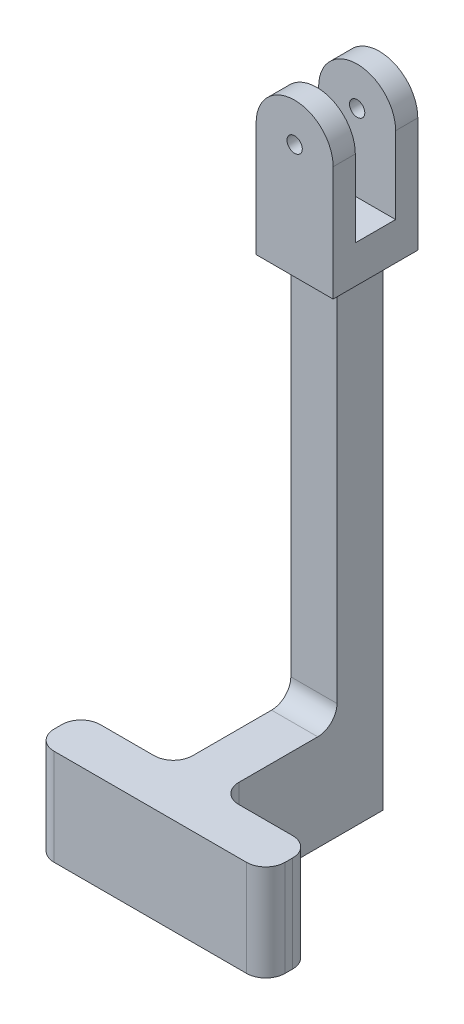
ISO-10303-21;
HEADER;
FILE_DESCRIPTION(('STEP AP214'),'2;1');
FILE_NAME('part.step','',(''),(''),'','','');
FILE_SCHEMA(('AUTOMOTIVE_DESIGN { 1 0 10303 214 1 1 1 1 }'));
ENDSEC;
DATA;
#1=APPLICATION_CONTEXT('core data for automotive mechanical design processes');
#2=APPLICATION_PROTOCOL_DEFINITION('international standard','automotive_design',2000,#1);
#3=PRODUCT_CONTEXT('',#1,'mechanical');
#4=PRODUCT('Part','Part','',(#3));
#5=PRODUCT_RELATED_PRODUCT_CATEGORY('part','',(#4));
#6=PRODUCT_DEFINITION_FORMATION('','',#4);
#7=PRODUCT_DEFINITION_CONTEXT('part definition',#1,'design');
#8=PRODUCT_DEFINITION('design','',#6,#7);
#9=PRODUCT_DEFINITION_SHAPE('','',#8);
#10=(LENGTH_UNIT() NAMED_UNIT(*) SI_UNIT(.MILLI.,.METRE.));
#11=(NAMED_UNIT(*) PLANE_ANGLE_UNIT() SI_UNIT($,.RADIAN.));
#12=(NAMED_UNIT(*) SI_UNIT($,.STERADIAN.) SOLID_ANGLE_UNIT());
#13=UNCERTAINTY_MEASURE_WITH_UNIT(LENGTH_MEASURE(1.E-05),#10,'distance_accuracy_value','');
#14=(GEOMETRIC_REPRESENTATION_CONTEXT(3) GLOBAL_UNCERTAINTY_ASSIGNED_CONTEXT((#13)) GLOBAL_UNIT_ASSIGNED_CONTEXT((#10,
#11,#12)) REPRESENTATION_CONTEXT('',''));
#15=CARTESIAN_POINT('',(0.,0.,0.));
#16=DIRECTION('',(0.,0.,1.));
#17=DIRECTION('',(1.,0.,0.));
#18=AXIS2_PLACEMENT_3D('',#15,#16,#17);
#19=CARTESIAN_POINT('',(0.,-130.276417548068,0.));
#20=DIRECTION('',(0.,0.,1.));
#21=DIRECTION('',(1.,0.,0.));
#22=AXIS2_PLACEMENT_3D('',#19,#20,#21);
#23=PLANE('',#22);
#24=DIRECTION('',(0.,1.,0.));
#25=VECTOR('',#24,1.);
#26=CARTESIAN_POINT('',(6.,-130.276417548068,0.));
#27=LINE('',#26,#25);
#28=CARTESIAN_POINT('',(6.,-155.276417548068,0.));
#29=VERTEX_POINT('',#28);
#30=CARTESIAN_POINT('',(6.,-30.2764175480678,0.));
#31=VERTEX_POINT('',#30);
#32=EDGE_CURVE('E262',#29,#31,#27,.T.);
#33=ORIENTED_EDGE('',*,*,#32,.F.);
#34=DIRECTION('',(1.,0.,0.));
#35=VECTOR('',#34,1.);
#36=CARTESIAN_POINT('',(-6.,-155.276417548068,0.));
#37=LINE('',#36,#35);
#38=CARTESIAN_POINT('',(-6.,-155.276417548068,0.));
#39=VERTEX_POINT('',#38);
#40=EDGE_CURVE('E249',#39,#29,#37,.T.);
#41=ORIENTED_EDGE('',*,*,#40,.F.);
#42=DIRECTION('',(0.,1.,0.));
#43=VECTOR('',#42,1.);
#44=CARTESIAN_POINT('',(-6.,-130.276417548068,0.));
#45=LINE('',#44,#43);
#46=CARTESIAN_POINT('',(-6.,-30.2764175480678,0.));
#47=VERTEX_POINT('',#46);
#48=EDGE_CURVE('E254',#39,#47,#45,.T.);
#49=ORIENTED_EDGE('',*,*,#48,.T.);
#50=DIRECTION('',(1.,0.,0.));
#51=VECTOR('',#50,1.);
#52=CARTESIAN_POINT('',(0.,-30.2764175480678,0.));
#53=LINE('',#52,#51);
#54=EDGE_CURVE('E295',#47,#31,#53,.T.);
#55=ORIENTED_EDGE('',*,*,#54,.T.);
#56=EDGE_LOOP('',(#33,#41,#49,#55));
#57=FACE_BOUND('',#56,.T.);
#58=ADVANCED_FACE('F67',(#57),#23,.F.);
#59=CARTESIAN_POINT('',(10.,0.,12.));
#60=DIRECTION('',(-1.,0.,0.));
#61=DIRECTION('',(0.,-1.,0.));
#62=AXIS2_PLACEMENT_3D('',#59,#60,#61);
#63=PLANE('',#62);
#64=DIRECTION('',(0.,1.,0.));
#65=VECTOR('',#64,1.);
#66=CARTESIAN_POINT('',(10.,0.,17.));
#67=LINE('',#66,#65);
#68=CARTESIAN_POINT('',(10.,-29.7764175480678,17.));
#69=VERTEX_POINT('',#68);
#70=CARTESIAN_POINT('',(10.,0.,17.));
#71=VERTEX_POINT('',#70);
#72=EDGE_CURVE('E327',#69,#71,#67,.T.);
#73=ORIENTED_EDGE('',*,*,#72,.F.);
#74=DIRECTION('',(0.,0.,-1.));
#75=VECTOR('',#74,1.);
#76=CARTESIAN_POINT('',(10.,-29.7764175480678,12.));
#77=LINE('',#76,#75);
#78=CARTESIAN_POINT('',(10.,-29.7764175480678,-5.));
#79=VERTEX_POINT('',#78);
#80=EDGE_CURVE('E392',#69,#79,#77,.T.);
#81=ORIENTED_EDGE('',*,*,#80,.T.);
#82=DIRECTION('',(0.,-1.,0.));
#83=VECTOR('',#82,1.);
#84=CARTESIAN_POINT('',(10.,0.,-5.));
#85=LINE('',#84,#83);
#86=CARTESIAN_POINT('',(10.,0.,-5.));
#87=VERTEX_POINT('',#86);
#88=EDGE_CURVE('E313',#87,#79,#85,.T.);
#89=ORIENTED_EDGE('',*,*,#88,.F.);
#90=DIRECTION('',(0.,0.,-1.));
#91=VECTOR('',#90,1.);
#92=CARTESIAN_POINT('',(10.,0.,12.));
#93=LINE('',#92,#91);
#94=CARTESIAN_POINT('',(10.,0.,0.759999999999997));
#95=VERTEX_POINT('',#94);
#96=EDGE_CURVE('E337',#95,#87,#93,.T.);
#97=ORIENTED_EDGE('',*,*,#96,.F.);
#98=DIRECTION('',(0.,-1.,0.));
#99=VECTOR('',#98,1.);
#100=CARTESIAN_POINT('',(10.,0.,0.759999999999997));
#101=LINE('',#100,#99);
#102=CARTESIAN_POINT('',(10.,-20.,0.759999999999997));
#103=VERTEX_POINT('',#102);
#104=EDGE_CURVE('E291',#95,#103,#101,.T.);
#105=ORIENTED_EDGE('',*,*,#104,.T.);
#106=DIRECTION('',(0.,0.,-1.));
#107=VECTOR('',#106,1.);
#108=CARTESIAN_POINT('',(10.,-20.,0.));
#109=LINE('',#108,#107);
#110=CARTESIAN_POINT('',(10.,-20.,11.24));
#111=VERTEX_POINT('',#110);
#112=EDGE_CURVE('E329',#111,#103,#109,.T.);
#113=ORIENTED_EDGE('',*,*,#112,.F.);
#114=DIRECTION('',(0.,1.,0.));
#115=VECTOR('',#114,1.);
#116=CARTESIAN_POINT('',(10.,0.,11.24));
#117=LINE('',#116,#115);
#118=CARTESIAN_POINT('',(10.,0.,11.24));
#119=VERTEX_POINT('',#118);
#120=EDGE_CURVE('E284',#111,#119,#117,.T.);
#121=ORIENTED_EDGE('',*,*,#120,.T.);
#122=EDGE_CURVE('E338',#71,#119,#93,.T.);
#123=ORIENTED_EDGE('',*,*,#122,.F.);
#124=EDGE_LOOP('',(#73,#81,#89,#97,#105,#113,#121,#123));
#125=FACE_BOUND('',#124,.T.);
#126=ADVANCED_FACE('F509',(#125),#63,.F.);
#127=CARTESIAN_POINT('',(0.,0.,12.));
#128=DIRECTION('',(0.,0.,-1.));
#129=DIRECTION('',(-1.,0.,0.));
#130=AXIS2_PLACEMENT_3D('',#127,#128,#129);
#131=CYLINDRICAL_SURFACE('',#130,10.);
#132=DIRECTION('',(0.,0.,-1.));
#133=VECTOR('',#132,1.);
#134=CARTESIAN_POINT('',(-10.,0.,12.));
#135=LINE('',#134,#133);
#136=CARTESIAN_POINT('',(-10.,0.,0.759999999999997));
#137=VERTEX_POINT('',#136);
#138=CARTESIAN_POINT('',(-10.,0.,-5.));
#139=VERTEX_POINT('',#138);
#140=EDGE_CURVE('E332',#137,#139,#135,.T.);
#141=ORIENTED_EDGE('',*,*,#140,.F.);
#142=CARTESIAN_POINT('',(0.,0.,0.759999999999997));
#143=DIRECTION('',(0.,0.,-1.));
#144=DIRECTION('',(-1.,0.,0.));
#145=AXIS2_PLACEMENT_3D('',#142,#143,#144);
#146=CIRCLE('',#145,10.);
#147=EDGE_CURVE('E288',#137,#95,#146,.T.);
#148=ORIENTED_EDGE('',*,*,#147,.T.);
#149=ORIENTED_EDGE('',*,*,#96,.T.);
#150=CARTESIAN_POINT('',(0.,0.,-5.));
#151=DIRECTION('',(0.,0.,-1.));
#152=DIRECTION('',(-1.,0.,0.));
#153=AXIS2_PLACEMENT_3D('',#150,#151,#152);
#154=CIRCLE('',#153,10.);
#155=EDGE_CURVE('E310',#139,#87,#154,.T.);
#156=ORIENTED_EDGE('',*,*,#155,.F.);
#157=EDGE_LOOP('',(#141,#148,#149,#156));
#158=FACE_BOUND('',#157,.T.);
#159=ADVANCED_FACE('F514',(#158),#131,.T.);
#160=CARTESIAN_POINT('',(-10.,0.,12.));
#161=DIRECTION('',(1.,0.,0.));
#162=DIRECTION('',(0.,1.,0.));
#163=AXIS2_PLACEMENT_3D('',#160,#161,#162);
#164=PLANE('',#163);
#165=DIRECTION('',(0.,1.,0.));
#166=VECTOR('',#165,1.);
#167=CARTESIAN_POINT('',(-10.,0.,-5.));
#168=LINE('',#167,#166);
#169=CARTESIAN_POINT('',(-10.,-29.7764175480678,-5.));
#170=VERTEX_POINT('',#169);
#171=EDGE_CURVE('E316',#170,#139,#168,.T.);
#172=ORIENTED_EDGE('',*,*,#171,.F.);
#173=DIRECTION('',(0.,0.,1.));
#174=VECTOR('',#173,1.);
#175=CARTESIAN_POINT('',(-10.,-29.7764175480678,12.));
#176=LINE('',#175,#174);
#177=CARTESIAN_POINT('',(-10.,-29.7764175480678,17.));
#178=VERTEX_POINT('',#177);
#179=EDGE_CURVE('E406',#170,#178,#176,.T.);
#180=ORIENTED_EDGE('',*,*,#179,.T.);
#181=DIRECTION('',(0.,-1.,0.));
#182=VECTOR('',#181,1.);
#183=CARTESIAN_POINT('',(-10.,0.,17.));
#184=LINE('',#183,#182);
#185=CARTESIAN_POINT('',(-10.,0.,17.));
#186=VERTEX_POINT('',#185);
#187=EDGE_CURVE('E324',#186,#178,#184,.T.);
#188=ORIENTED_EDGE('',*,*,#187,.F.);
#189=CARTESIAN_POINT('',(-10.,0.,11.24));
#190=VERTEX_POINT('',#189);
#191=EDGE_CURVE('E334',#186,#190,#135,.T.);
#192=ORIENTED_EDGE('',*,*,#191,.T.);
#193=DIRECTION('',(0.,1.,0.));
#194=VECTOR('',#193,1.);
#195=CARTESIAN_POINT('',(-10.,0.,11.24));
#196=LINE('',#195,#194);
#197=CARTESIAN_POINT('',(-10.,-20.,11.24));
#198=VERTEX_POINT('',#197);
#199=EDGE_CURVE('E272',#198,#190,#196,.T.);
#200=ORIENTED_EDGE('',*,*,#199,.F.);
#201=DIRECTION('',(0.,0.,-1.));
#202=VECTOR('',#201,1.);
#203=CARTESIAN_POINT('',(-10.,-20.,0.));
#204=LINE('',#203,#202);
#205=CARTESIAN_POINT('',(-10.,-20.,0.759999999999997));
#206=VERTEX_POINT('',#205);
#207=EDGE_CURVE('E330',#198,#206,#204,.T.);
#208=ORIENTED_EDGE('',*,*,#207,.T.);
#209=DIRECTION('',(0.,-1.,0.));
#210=VECTOR('',#209,1.);
#211=CARTESIAN_POINT('',(-10.,0.,0.759999999999997));
#212=LINE('',#211,#210);
#213=EDGE_CURVE('E266',#137,#206,#212,.T.);
#214=ORIENTED_EDGE('',*,*,#213,.F.);
#215=ORIENTED_EDGE('',*,*,#140,.T.);
#216=EDGE_LOOP('',(#172,#180,#188,#192,#200,#208,#214,#215));
#217=FACE_BOUND('',#216,.T.);
#218=ADVANCED_FACE('F539',(#217),#164,.F.);
#219=CARTESIAN_POINT('',(0.,0.,12.));
#220=DIRECTION('',(0.,0.,-1.));
#221=DIRECTION('',(-1.,0.,0.));
#222=AXIS2_PLACEMENT_3D('',#219,#220,#221);
#223=CYLINDRICAL_SURFACE('',#222,1.985);
#224=CARTESIAN_POINT('',(0.,0.,0.759999999999997));
#225=DIRECTION('',(0.,0.,-1.));
#226=DIRECTION('',(-1.,0.,0.));
#227=AXIS2_PLACEMENT_3D('',#224,#225,#226);
#228=CIRCLE('',#227,1.985);
#229=CARTESIAN_POINT('',(-1.985,0.,0.759999999999997));
#230=VERTEX_POINT('',#229);
#231=EDGE_CURVE('E287',#230,#230,#228,.T.);
#232=ORIENTED_EDGE('',*,*,#231,.F.);
#233=EDGE_LOOP('',(#232));
#234=FACE_BOUND('',#233,.T.);
#235=CARTESIAN_POINT('',(0.,0.,-5.));
#236=DIRECTION('',(0.,0.,-1.));
#237=DIRECTION('',(-1.,0.,0.));
#238=AXIS2_PLACEMENT_3D('',#235,#236,#237);
#239=CIRCLE('',#238,1.985);
#240=CARTESIAN_POINT('',(-1.985,0.,-5.));
#241=VERTEX_POINT('',#240);
#242=EDGE_CURVE('E261',#241,#241,#239,.F.);
#243=ORIENTED_EDGE('',*,*,#242,.F.);
#244=EDGE_LOOP('',(#243));
#245=FACE_BOUND('',#244,.T.);
#246=ADVANCED_FACE('F542',(#234,#245),#223,.F.);
#247=CARTESIAN_POINT('',(0.,0.,11.24));
#248=DIRECTION('',(0.,0.,1.));
#249=DIRECTION('',(1.,0.,0.));
#250=AXIS2_PLACEMENT_3D('',#247,#248,#249);
#251=CIRCLE('',#250,10.);
#252=EDGE_CURVE('E282',#119,#190,#251,.T.);
#253=ORIENTED_EDGE('',*,*,#252,.T.);
#254=ORIENTED_EDGE('',*,*,#191,.F.);
#255=CARTESIAN_POINT('',(0.,0.,17.));
#256=DIRECTION('',(0.,0.,1.));
#257=DIRECTION('',(1.,0.,0.));
#258=AXIS2_PLACEMENT_3D('',#255,#256,#257);
#259=CIRCLE('',#258,10.);
#260=EDGE_CURVE('E321',#71,#186,#259,.T.);
#261=ORIENTED_EDGE('',*,*,#260,.F.);
#262=ORIENTED_EDGE('',*,*,#122,.T.);
#263=EDGE_LOOP('',(#253,#254,#261,#262));
#264=FACE_BOUND('',#263,.T.);
#265=ADVANCED_FACE('F546',(#264),#131,.T.);
#266=CARTESIAN_POINT('',(0.,0.,11.24));
#267=DIRECTION('',(0.,0.,1.));
#268=DIRECTION('',(1.,0.,0.));
#269=AXIS2_PLACEMENT_3D('',#266,#267,#268);
#270=CIRCLE('',#269,1.985);
#271=CARTESIAN_POINT('',(1.985,0.,11.24));
#272=VERTEX_POINT('',#271);
#273=EDGE_CURVE('E279',#272,#272,#270,.T.);
#274=ORIENTED_EDGE('',*,*,#273,.F.);
#275=EDGE_LOOP('',(#274));
#276=FACE_BOUND('',#275,.T.);
#277=CARTESIAN_POINT('',(0.,0.,17.));
#278=DIRECTION('',(0.,0.,1.));
#279=DIRECTION('',(1.,0.,0.));
#280=AXIS2_PLACEMENT_3D('',#277,#278,#279);
#281=CIRCLE('',#280,1.985);
#282=CARTESIAN_POINT('',(1.985,0.,17.));
#283=VERTEX_POINT('',#282);
#284=EDGE_CURVE('E318',#283,#283,#281,.F.);
#285=ORIENTED_EDGE('',*,*,#284,.F.);
#286=EDGE_LOOP('',(#285));
#287=FACE_BOUND('',#286,.T.);
#288=ADVANCED_FACE('F537',(#276,#287),#223,.F.);
#289=CARTESIAN_POINT('',(0.,-30.2764175480678,12.));
#290=DIRECTION('',(0.,1.,0.));
#291=DIRECTION('',(0.,0.,1.));
#292=AXIS2_PLACEMENT_3D('',#289,#290,#291);
#293=PLANE('',#292);
#294=DIRECTION('',(1.,0.,0.));
#295=VECTOR('',#294,1.);
#296=CARTESIAN_POINT('',(10.,-30.2764175480678,-4.5));
#297=LINE('',#296,#295);
#298=CARTESIAN_POINT('',(-9.5,-30.2764175480678,-4.5));
#299=VERTEX_POINT('',#298);
#300=CARTESIAN_POINT('',(9.5,-30.2764175480678,-4.5));
#301=VERTEX_POINT('',#300);
#302=EDGE_CURVE('E395',#299,#301,#297,.T.);
#303=ORIENTED_EDGE('',*,*,#302,.T.);
#304=DIRECTION('',(0.,0.,1.));
#305=VECTOR('',#304,1.);
#306=CARTESIAN_POINT('',(9.5,-30.2764175480678,12.));
#307=LINE('',#306,#305);
#308=CARTESIAN_POINT('',(9.5,-30.2764175480678,16.5));
#309=VERTEX_POINT('',#308);
#310=EDGE_CURVE('E401',#301,#309,#307,.T.);
#311=ORIENTED_EDGE('',*,*,#310,.T.);
#312=DIRECTION('',(-1.,0.,0.));
#313=VECTOR('',#312,1.);
#314=CARTESIAN_POINT('',(-10.,-30.2764175480678,16.5));
#315=LINE('',#314,#313);
#316=CARTESIAN_POINT('',(-9.5,-30.2764175480678,16.5));
#317=VERTEX_POINT('',#316);
#318=EDGE_CURVE('E399',#309,#317,#315,.T.);
#319=ORIENTED_EDGE('',*,*,#318,.T.);
#320=DIRECTION('',(0.,0.,-1.));
#321=VECTOR('',#320,1.);
#322=CARTESIAN_POINT('',(-9.5,-30.2764175480678,12.));
#323=LINE('',#322,#321);
#324=EDGE_CURVE('E397',#317,#299,#323,.T.);
#325=ORIENTED_EDGE('',*,*,#324,.T.);
#326=EDGE_LOOP('',(#303,#311,#319,#325));
#327=FACE_BOUND('',#326,.T.);
#328=ORIENTED_EDGE('',*,*,#54,.F.);
#329=DIRECTION('',(0.,0.,1.));
#330=VECTOR('',#329,1.);
#331=CARTESIAN_POINT('',(-6.,-30.2764175480678,0.));
#332=LINE('',#331,#330);
#333=CARTESIAN_POINT('',(-6.,-30.2764175480678,12.));
#334=VERTEX_POINT('',#333);
#335=EDGE_CURVE('E257',#47,#334,#332,.T.);
#336=ORIENTED_EDGE('',*,*,#335,.T.);
#337=DIRECTION('',(1.,0.,0.));
#338=VECTOR('',#337,1.);
#339=CARTESIAN_POINT('',(0.,-30.2764175480678,12.));
#340=LINE('',#339,#338);
#341=CARTESIAN_POINT('',(6.,-30.2764175480678,12.));
#342=VERTEX_POINT('',#341);
#343=EDGE_CURVE('E300',#334,#342,#340,.T.);
#344=ORIENTED_EDGE('',*,*,#343,.T.);
#345=DIRECTION('',(0.,0.,1.));
#346=VECTOR('',#345,1.);
#347=CARTESIAN_POINT('',(6.,-30.2764175480678,0.));
#348=LINE('',#347,#346);
#349=EDGE_CURVE('E297',#31,#342,#348,.T.);
#350=ORIENTED_EDGE('',*,*,#349,.F.);
#351=EDGE_LOOP('',(#328,#336,#344,#350));
#352=FACE_BOUND('',#351,.T.);
#353=ADVANCED_FACE('F533',(#327,#352),#293,.F.);
#354=CARTESIAN_POINT('',(-10.,-20.,0.));
#355=DIRECTION('',(0.,-1.,0.));
#356=DIRECTION('',(0.,0.,-1.));
#357=AXIS2_PLACEMENT_3D('',#354,#355,#356);
#358=PLANE('',#357);
#359=ORIENTED_EDGE('',*,*,#112,.T.);
#360=DIRECTION('',(-1.,0.,0.));
#361=VECTOR('',#360,1.);
#362=CARTESIAN_POINT('',(176.,-20.,0.759999999999997));
#363=LINE('',#362,#361);
#364=EDGE_CURVE('E275',#103,#206,#363,.T.);
#365=ORIENTED_EDGE('',*,*,#364,.T.);
#366=ORIENTED_EDGE('',*,*,#207,.F.);
#367=DIRECTION('',(-1.,0.,0.));
#368=VECTOR('',#367,1.);
#369=CARTESIAN_POINT('',(176.,-20.,11.24));
#370=LINE('',#369,#368);
#371=EDGE_CURVE('E276',#111,#198,#370,.T.);
#372=ORIENTED_EDGE('',*,*,#371,.F.);
#373=EDGE_LOOP('',(#359,#365,#366,#372));
#374=FACE_BOUND('',#373,.T.);
#375=ADVANCED_FACE('F529',(#374),#358,.F.);
#376=CARTESIAN_POINT('',(0.,0.,17.));
#377=DIRECTION('',(0.,0.,1.));
#378=DIRECTION('',(1.,0.,0.));
#379=AXIS2_PLACEMENT_3D('',#376,#377,#378);
#380=PLANE('',#379);
#381=ORIENTED_EDGE('',*,*,#284,.T.);
#382=EDGE_LOOP('',(#381));
#383=FACE_BOUND('',#382,.T.);
#384=ORIENTED_EDGE('',*,*,#187,.T.);
#385=DIRECTION('',(1.,0.,0.));
#386=VECTOR('',#385,1.);
#387=CARTESIAN_POINT('',(10.,-29.7764175480678,17.));
#388=LINE('',#387,#386);
#389=EDGE_CURVE('E404',#178,#69,#388,.T.);
#390=ORIENTED_EDGE('',*,*,#389,.T.);
#391=ORIENTED_EDGE('',*,*,#72,.T.);
#392=ORIENTED_EDGE('',*,*,#260,.T.);
#393=EDGE_LOOP('',(#384,#390,#391,#392));
#394=FACE_BOUND('',#393,.T.);
#395=ADVANCED_FACE('F525',(#383,#394),#380,.T.);
#396=CARTESIAN_POINT('',(0.,0.,-5.));
#397=DIRECTION('',(0.,0.,-1.));
#398=DIRECTION('',(-1.,0.,0.));
#399=AXIS2_PLACEMENT_3D('',#396,#397,#398);
#400=PLANE('',#399);
#401=ORIENTED_EDGE('',*,*,#242,.T.);
#402=EDGE_LOOP('',(#401));
#403=FACE_BOUND('',#402,.T.);
#404=ORIENTED_EDGE('',*,*,#88,.T.);
#405=DIRECTION('',(-1.,0.,0.));
#406=VECTOR('',#405,1.);
#407=CARTESIAN_POINT('',(-10.,-29.7764175480678,-5.));
#408=LINE('',#407,#406);
#409=EDGE_CURVE('E408',#79,#170,#408,.T.);
#410=ORIENTED_EDGE('',*,*,#409,.T.);
#411=ORIENTED_EDGE('',*,*,#171,.T.);
#412=ORIENTED_EDGE('',*,*,#155,.T.);
#413=EDGE_LOOP('',(#404,#410,#411,#412));
#414=FACE_BOUND('',#413,.T.);
#415=ADVANCED_FACE('F522',(#403,#414),#400,.T.);
#416=CARTESIAN_POINT('',(-6.,-130.276417548068,0.));
#417=DIRECTION('',(-1.,0.,0.));
#418=DIRECTION('',(0.,0.,1.));
#419=AXIS2_PLACEMENT_3D('',#416,#417,#418);
#420=PLANE('',#419);
#421=DIRECTION('',(0.,0.,-1.));
#422=VECTOR('',#421,1.);
#423=CARTESIAN_POINT('',(-6.,-155.276417548068,29.9201970855008));
#424=LINE('',#423,#422);
#425=CARTESIAN_POINT('',(-6.,-155.276417548068,37.5));
#426=VERTEX_POINT('',#425);
#427=EDGE_CURVE('E243',#426,#39,#424,.T.);
#428=ORIENTED_EDGE('',*,*,#427,.F.);
#429=DIRECTION('',(0.,-1.,0.));
#430=VECTOR('',#429,1.);
#431=CARTESIAN_POINT('',(-6.,-130.276417548068,37.5));
#432=LINE('',#431,#430);
#433=CARTESIAN_POINT('',(-6.,-130.276417548068,37.5));
#434=VERTEX_POINT('',#433);
#435=EDGE_CURVE('E88',#426,#434,#432,.F.);
#436=ORIENTED_EDGE('',*,*,#435,.T.);
#437=DIRECTION('',(0.,0.,1.));
#438=VECTOR('',#437,1.);
#439=CARTESIAN_POINT('',(-6.,-130.276417548068,0.));
#440=LINE('',#439,#438);
#441=CARTESIAN_POINT('',(-6.,-130.276417548068,17.));
#442=VERTEX_POINT('',#441);
#443=EDGE_CURVE('E457',#442,#434,#440,.T.);
#444=ORIENTED_EDGE('',*,*,#443,.F.);
#445=CARTESIAN_POINT('',(-6.,-125.276417548068,17.));
#446=DIRECTION('',(-1.,0.,0.));
#447=DIRECTION('',(0.,0.,1.));
#448=AXIS2_PLACEMENT_3D('',#445,#446,#447);
#449=CIRCLE('',#448,5.);
#450=CARTESIAN_POINT('',(-6.,-125.276417548068,12.));
#451=VERTEX_POINT('',#450);
#452=EDGE_CURVE('E388',#442,#451,#449,.F.);
#453=ORIENTED_EDGE('',*,*,#452,.T.);
#454=DIRECTION('',(0.,1.,0.));
#455=VECTOR('',#454,1.);
#456=CARTESIAN_POINT('',(-6.,-130.276417548068,12.));
#457=LINE('',#456,#455);
#458=EDGE_CURVE('E303',#451,#334,#457,.T.);
#459=ORIENTED_EDGE('',*,*,#458,.T.);
#460=ORIENTED_EDGE('',*,*,#335,.F.);
#461=ORIENTED_EDGE('',*,*,#48,.F.);
#462=EDGE_LOOP('',(#428,#436,#444,#453,#459,#460,#461));
#463=FACE_BOUND('',#462,.T.);
#464=ADVANCED_FACE('F255',(#463),#420,.T.);
#465=CARTESIAN_POINT('',(6.,-130.276417548068,0.));
#466=DIRECTION('',(-1.,0.,0.));
#467=DIRECTION('',(0.,0.,1.));
#468=AXIS2_PLACEMENT_3D('',#465,#466,#467);
#469=PLANE('',#468);
#470=DIRECTION('',(0.,0.,1.));
#471=VECTOR('',#470,1.);
#472=CARTESIAN_POINT('',(6.,-130.276417548068,0.));
#473=LINE('',#472,#471);
#474=CARTESIAN_POINT('',(6.,-130.276417548068,17.));
#475=VERTEX_POINT('',#474);
#476=CARTESIAN_POINT('',(6.,-130.276417548068,37.5));
#477=VERTEX_POINT('',#476);
#478=EDGE_CURVE('E251',#475,#477,#473,.T.);
#479=ORIENTED_EDGE('',*,*,#478,.T.);
#480=DIRECTION('',(0.,1.,0.));
#481=VECTOR('',#480,1.);
#482=CARTESIAN_POINT('',(6.,-155.276417548068,37.5));
#483=LINE('',#482,#481);
#484=CARTESIAN_POINT('',(6.,-155.276417548068,37.5));
#485=VERTEX_POINT('',#484);
#486=EDGE_CURVE('E424',#477,#485,#483,.F.);
#487=ORIENTED_EDGE('',*,*,#486,.T.);
#488=DIRECTION('',(0.,0.,1.));
#489=VECTOR('',#488,1.);
#490=CARTESIAN_POINT('',(6.,-155.276417548068,0.));
#491=LINE('',#490,#489);
#492=EDGE_CURVE('E264',#29,#485,#491,.T.);
#493=ORIENTED_EDGE('',*,*,#492,.F.);
#494=ORIENTED_EDGE('',*,*,#32,.T.);
#495=ORIENTED_EDGE('',*,*,#349,.T.);
#496=DIRECTION('',(0.,1.,0.));
#497=VECTOR('',#496,1.);
#498=CARTESIAN_POINT('',(6.,-130.276417548068,12.));
#499=LINE('',#498,#497);
#500=CARTESIAN_POINT('',(6.,-125.276417548068,12.));
#501=VERTEX_POINT('',#500);
#502=EDGE_CURVE('E305',#501,#342,#499,.T.);
#503=ORIENTED_EDGE('',*,*,#502,.F.);
#504=CARTESIAN_POINT('',(6.,-125.276417548068,17.));
#505=DIRECTION('',(-1.,0.,0.));
#506=DIRECTION('',(0.,0.,1.));
#507=AXIS2_PLACEMENT_3D('',#504,#505,#506);
#508=CIRCLE('',#507,5.);
#509=EDGE_CURVE('E390',#501,#475,#508,.T.);
#510=ORIENTED_EDGE('',*,*,#509,.T.);
#511=EDGE_LOOP('',(#479,#487,#493,#494,#495,#503,#510));
#512=FACE_BOUND('',#511,.T.);
#513=ADVANCED_FACE('F454',(#512),#469,.F.);
#514=CARTESIAN_POINT('',(0.,-130.276417548068,12.));
#515=DIRECTION('',(0.,0.,1.));
#516=DIRECTION('',(1.,0.,0.));
#517=AXIS2_PLACEMENT_3D('',#514,#515,#516);
#518=PLANE('',#517);
#519=ORIENTED_EDGE('',*,*,#458,.F.);
#520=DIRECTION('',(-1.,0.,0.));
#521=VECTOR('',#520,1.);
#522=CARTESIAN_POINT('',(0.,-125.276417548068,12.));
#523=LINE('',#522,#521);
#524=EDGE_CURVE('E386',#451,#501,#523,.F.);
#525=ORIENTED_EDGE('',*,*,#524,.T.);
#526=ORIENTED_EDGE('',*,*,#502,.T.);
#527=ORIENTED_EDGE('',*,*,#343,.F.);
#528=EDGE_LOOP('',(#519,#525,#526,#527));
#529=FACE_BOUND('',#528,.T.);
#530=ADVANCED_FACE('F577',(#529),#518,.T.);
#531=CARTESIAN_POINT('',(176.,0.,0.759999999999997));
#532=DIRECTION('',(0.,0.,-1.));
#533=DIRECTION('',(-1.,0.,0.));
#534=AXIS2_PLACEMENT_3D('',#531,#532,#533);
#535=PLANE('',#534);
#536=ORIENTED_EDGE('',*,*,#231,.T.);
#537=EDGE_LOOP('',(#536));
#538=FACE_BOUND('',#537,.T.);
#539=ORIENTED_EDGE('',*,*,#147,.F.);
#540=ORIENTED_EDGE('',*,*,#213,.T.);
#541=ORIENTED_EDGE('',*,*,#364,.F.);
#542=ORIENTED_EDGE('',*,*,#104,.F.);
#543=EDGE_LOOP('',(#539,#540,#541,#542));
#544=FACE_BOUND('',#543,.T.);
#545=ADVANCED_FACE('F738',(#538,#544),#535,.F.);
#546=CARTESIAN_POINT('',(176.,0.,11.24));
#547=DIRECTION('',(0.,0.,1.));
#548=DIRECTION('',(1.,0.,0.));
#549=AXIS2_PLACEMENT_3D('',#546,#547,#548);
#550=PLANE('',#549);
#551=ORIENTED_EDGE('',*,*,#273,.T.);
#552=EDGE_LOOP('',(#551));
#553=FACE_BOUND('',#552,.T.);
#554=ORIENTED_EDGE('',*,*,#371,.T.);
#555=ORIENTED_EDGE('',*,*,#199,.T.);
#556=ORIENTED_EDGE('',*,*,#252,.F.);
#557=ORIENTED_EDGE('',*,*,#120,.F.);
#558=EDGE_LOOP('',(#554,#555,#556,#557));
#559=FACE_BOUND('',#558,.T.);
#560=ADVANCED_FACE('F649',(#553,#559),#550,.F.);
#561=CARTESIAN_POINT('',(0.,-155.276417548068,0.));
#562=DIRECTION('',(0.,-1.,0.));
#563=DIRECTION('',(0.,0.,-1.));
#564=AXIS2_PLACEMENT_3D('',#561,#562,#563);
#565=PLANE('',#564);
#566=DIRECTION('',(0.,0.,-1.));
#567=VECTOR('',#566,1.);
#568=CARTESIAN_POINT('',(-30.,-155.276417548068,54.5));
#569=LINE('',#568,#567);
#570=CARTESIAN_POINT('',(-30.,-155.276417548068,49.5));
#571=VERTEX_POINT('',#570);
#572=CARTESIAN_POINT('',(-30.,-155.276417548068,47.5));
#573=VERTEX_POINT('',#572);
#574=EDGE_CURVE('E463',#571,#573,#569,.T.);
#575=ORIENTED_EDGE('',*,*,#574,.T.);
#576=CARTESIAN_POINT('',(-25.,-155.276417548068,47.5));
#577=DIRECTION('',(0.,-1.,0.));
#578=DIRECTION('',(0.,0.,-1.));
#579=AXIS2_PLACEMENT_3D('',#576,#577,#578);
#580=CIRCLE('',#579,5.);
#581=CARTESIAN_POINT('',(-25.,-155.276417548068,42.5));
#582=VERTEX_POINT('',#581);
#583=EDGE_CURVE('E368',#573,#582,#580,.T.);
#584=ORIENTED_EDGE('',*,*,#583,.T.);
#585=DIRECTION('',(-1.,0.,0.));
#586=VECTOR('',#585,1.);
#587=CARTESIAN_POINT('',(0.,-155.276417548068,42.5));
#588=LINE('',#587,#586);
#589=CARTESIAN_POINT('',(-11.,-155.276417548068,42.5));
#590=VERTEX_POINT('',#589);
#591=EDGE_CURVE('E445',#590,#582,#588,.T.);
#592=ORIENTED_EDGE('',*,*,#591,.F.);
#593=CARTESIAN_POINT('',(-11.,-155.276417548068,37.5));
#594=DIRECTION('',(0.,-1.,0.));
#595=DIRECTION('',(0.,0.,-1.));
#596=AXIS2_PLACEMENT_3D('',#593,#594,#595);
#597=CIRCLE('',#596,5.);
#598=EDGE_CURVE('E75',#590,#426,#597,.F.);
#599=ORIENTED_EDGE('',*,*,#598,.T.);
#600=ORIENTED_EDGE('',*,*,#427,.T.);
#601=ORIENTED_EDGE('',*,*,#40,.T.);
#602=ORIENTED_EDGE('',*,*,#492,.T.);
#603=CARTESIAN_POINT('',(11.,-155.276417548068,37.5));
#604=DIRECTION('',(0.,-1.,0.));
#605=DIRECTION('',(0.,0.,-1.));
#606=AXIS2_PLACEMENT_3D('',#603,#604,#605);
#607=CIRCLE('',#606,5.);
#608=CARTESIAN_POINT('',(11.,-155.276417548068,42.5));
#609=VERTEX_POINT('',#608);
#610=EDGE_CURVE('E432',#485,#609,#607,.F.);
#611=ORIENTED_EDGE('',*,*,#610,.T.);
#612=CARTESIAN_POINT('',(25.,-155.276417548068,42.5));
#613=VERTEX_POINT('',#612);
#614=EDGE_CURVE('E436',#613,#609,#588,.T.);
#615=ORIENTED_EDGE('',*,*,#614,.F.);
#616=CARTESIAN_POINT('',(25.,-155.276417548068,47.5));
#617=DIRECTION('',(0.,-1.,0.));
#618=DIRECTION('',(0.,0.,-1.));
#619=AXIS2_PLACEMENT_3D('',#616,#617,#618);
#620=CIRCLE('',#619,5.);
#621=CARTESIAN_POINT('',(30.,-155.276417548068,47.5));
#622=VERTEX_POINT('',#621);
#623=EDGE_CURVE('E364',#613,#622,#620,.T.);
#624=ORIENTED_EDGE('',*,*,#623,.T.);
#625=DIRECTION('',(0.,0.,-1.));
#626=VECTOR('',#625,1.);
#627=CARTESIAN_POINT('',(30.,-155.276417548068,54.5));
#628=LINE('',#627,#626);
#629=CARTESIAN_POINT('',(30.,-155.276417548068,49.5));
#630=VERTEX_POINT('',#629);
#631=EDGE_CURVE('E465',#630,#622,#628,.T.);
#632=ORIENTED_EDGE('',*,*,#631,.F.);
#633=CARTESIAN_POINT('',(25.,-155.276417548068,49.5));
#634=DIRECTION('',(0.,-1.,0.));
#635=DIRECTION('',(0.,0.,-1.));
#636=AXIS2_PLACEMENT_3D('',#633,#634,#635);
#637=CIRCLE('',#636,5.);
#638=CARTESIAN_POINT('',(25.,-155.276417548068,54.5));
#639=VERTEX_POINT('',#638);
#640=EDGE_CURVE('E362',#630,#639,#637,.T.);
#641=ORIENTED_EDGE('',*,*,#640,.T.);
#642=DIRECTION('',(-1.,0.,0.));
#643=VECTOR('',#642,1.);
#644=CARTESIAN_POINT('',(0.,-155.276417548068,54.5));
#645=LINE('',#644,#643);
#646=CARTESIAN_POINT('',(-25.,-155.276417548068,54.5));
#647=VERTEX_POINT('',#646);
#648=EDGE_CURVE('E470',#639,#647,#645,.T.);
#649=ORIENTED_EDGE('',*,*,#648,.T.);
#650=CARTESIAN_POINT('',(-25.,-155.276417548068,49.5));
#651=DIRECTION('',(0.,-1.,0.));
#652=DIRECTION('',(0.,0.,-1.));
#653=AXIS2_PLACEMENT_3D('',#650,#651,#652);
#654=CIRCLE('',#653,5.);
#655=EDGE_CURVE('E366',#647,#571,#654,.T.);
#656=ORIENTED_EDGE('',*,*,#655,.T.);
#657=EDGE_LOOP('',(#575,#584,#592,#599,#600,#601,#602,#611,#615,#624,#632,#641,#649,#656));
#658=FACE_BOUND('',#657,.T.);
#659=ADVANCED_FACE('F246',(#658),#565,.T.);
#660=CARTESIAN_POINT('',(30.,-130.276417548068,12.));
#661=DIRECTION('',(0.,-1.,0.));
#662=DIRECTION('',(0.,0.,-1.));
#663=AXIS2_PLACEMENT_3D('',#660,#661,#662);
#664=PLANE('',#663);
#665=ORIENTED_EDGE('',*,*,#478,.F.);
#666=DIRECTION('',(-1.,0.,0.));
#667=VECTOR('',#666,1.);
#668=CARTESIAN_POINT('',(30.,-130.276417548068,17.));
#669=LINE('',#668,#667);
#670=EDGE_CURVE('E383',#475,#442,#669,.T.);
#671=ORIENTED_EDGE('',*,*,#670,.T.);
#672=ORIENTED_EDGE('',*,*,#443,.T.);
#673=CARTESIAN_POINT('',(-11.,-130.276417548068,37.5));
#674=DIRECTION('',(0.,-1.,0.));
#675=DIRECTION('',(0.,0.,-1.));
#676=AXIS2_PLACEMENT_3D('',#673,#674,#675);
#677=CIRCLE('',#676,5.);
#678=CARTESIAN_POINT('',(-11.,-130.276417548068,42.5));
#679=VERTEX_POINT('',#678);
#680=EDGE_CURVE('E12',#434,#679,#677,.T.);
#681=ORIENTED_EDGE('',*,*,#680,.T.);
#682=DIRECTION('',(1.,0.,0.));
#683=VECTOR('',#682,1.);
#684=CARTESIAN_POINT('',(0.,-130.276417548068,42.5));
#685=LINE('',#684,#683);
#686=CARTESIAN_POINT('',(-25.,-130.276417548068,42.5));
#687=VERTEX_POINT('',#686);
#688=EDGE_CURVE('E472',#687,#679,#685,.T.);
#689=ORIENTED_EDGE('',*,*,#688,.F.);
#690=CARTESIAN_POINT('',(-25.,-130.276417548068,47.5));
#691=DIRECTION('',(0.,-1.,0.));
#692=DIRECTION('',(0.,0.,-1.));
#693=AXIS2_PLACEMENT_3D('',#690,#691,#692);
#694=CIRCLE('',#693,5.);
#695=CARTESIAN_POINT('',(-30.,-130.276417548068,47.5));
#696=VERTEX_POINT('',#695);
#697=EDGE_CURVE('E355',#687,#696,#694,.F.);
#698=ORIENTED_EDGE('',*,*,#697,.T.);
#699=DIRECTION('',(0.,0.,-1.));
#700=VECTOR('',#699,1.);
#701=CARTESIAN_POINT('',(-30.,-130.276417548068,54.5));
#702=LINE('',#701,#700);
#703=CARTESIAN_POINT('',(-30.,-130.276417548068,49.5));
#704=VERTEX_POINT('',#703);
#705=EDGE_CURVE('E458',#704,#696,#702,.T.);
#706=ORIENTED_EDGE('',*,*,#705,.F.);
#707=CARTESIAN_POINT('',(-25.,-130.276417548068,49.5));
#708=DIRECTION('',(0.,-1.,0.));
#709=DIRECTION('',(0.,0.,-1.));
#710=AXIS2_PLACEMENT_3D('',#707,#708,#709);
#711=CIRCLE('',#710,5.);
#712=CARTESIAN_POINT('',(-25.,-130.276417548068,54.5));
#713=VERTEX_POINT('',#712);
#714=EDGE_CURVE('E353',#704,#713,#711,.F.);
#715=ORIENTED_EDGE('',*,*,#714,.T.);
#716=DIRECTION('',(1.,0.,0.));
#717=VECTOR('',#716,1.);
#718=CARTESIAN_POINT('',(0.,-130.276417548068,54.5));
#719=LINE('',#718,#717);
#720=CARTESIAN_POINT('',(25.,-130.276417548068,54.5));
#721=VERTEX_POINT('',#720);
#722=EDGE_CURVE('E444',#713,#721,#719,.T.);
#723=ORIENTED_EDGE('',*,*,#722,.T.);
#724=CARTESIAN_POINT('',(25.,-130.276417548068,49.5));
#725=DIRECTION('',(0.,-1.,0.));
#726=DIRECTION('',(0.,0.,-1.));
#727=AXIS2_PLACEMENT_3D('',#724,#725,#726);
#728=CIRCLE('',#727,5.);
#729=CARTESIAN_POINT('',(30.,-130.276417548068,49.5));
#730=VERTEX_POINT('',#729);
#731=EDGE_CURVE('E348',#721,#730,#728,.F.);
#732=ORIENTED_EDGE('',*,*,#731,.T.);
#733=DIRECTION('',(0.,0.,-1.));
#734=VECTOR('',#733,1.);
#735=CARTESIAN_POINT('',(30.,-130.276417548068,54.5));
#736=LINE('',#735,#734);
#737=CARTESIAN_POINT('',(30.,-130.276417548068,47.5));
#738=VERTEX_POINT('',#737);
#739=EDGE_CURVE('E468',#730,#738,#736,.T.);
#740=ORIENTED_EDGE('',*,*,#739,.T.);
#741=CARTESIAN_POINT('',(25.,-130.276417548068,47.5));
#742=DIRECTION('',(0.,-1.,0.));
#743=DIRECTION('',(0.,0.,-1.));
#744=AXIS2_PLACEMENT_3D('',#741,#742,#743);
#745=CIRCLE('',#744,5.);
#746=CARTESIAN_POINT('',(25.,-130.276417548068,42.5));
#747=VERTEX_POINT('',#746);
#748=EDGE_CURVE('E350',#738,#747,#745,.F.);
#749=ORIENTED_EDGE('',*,*,#748,.T.);
#750=CARTESIAN_POINT('',(11.,-130.276417548068,42.5));
#751=VERTEX_POINT('',#750);
#752=EDGE_CURVE('E421',#751,#747,#685,.T.);
#753=ORIENTED_EDGE('',*,*,#752,.F.);
#754=CARTESIAN_POINT('',(11.,-130.276417548068,37.5));
#755=DIRECTION('',(0.,-1.,0.));
#756=DIRECTION('',(0.,0.,-1.));
#757=AXIS2_PLACEMENT_3D('',#754,#755,#756);
#758=CIRCLE('',#757,5.);
#759=EDGE_CURVE('E430',#751,#477,#758,.T.);
#760=ORIENTED_EDGE('',*,*,#759,.T.);
#761=EDGE_LOOP('',(#665,#671,#672,#681,#689,#698,#706,#715,#723,#732,#740,#749,#753,#760));
#762=FACE_BOUND('',#761,.T.);
#763=ADVANCED_FACE('F451',(#762),#664,.F.);
#764=CARTESIAN_POINT('',(0.,0.,42.5));
#765=DIRECTION('',(0.,0.,1.));
#766=DIRECTION('',(1.,0.,0.));
#767=AXIS2_PLACEMENT_3D('',#764,#765,#766);
#768=PLANE('',#767);
#769=ORIENTED_EDGE('',*,*,#614,.T.);
#770=DIRECTION('',(0.,1.,0.));
#771=VECTOR('',#770,1.);
#772=CARTESIAN_POINT('',(11.,-130.276417548068,42.5));
#773=LINE('',#772,#771);
#774=EDGE_CURVE('E410',#609,#751,#773,.T.);
#775=ORIENTED_EDGE('',*,*,#774,.T.);
#776=ORIENTED_EDGE('',*,*,#752,.T.);
#777=DIRECTION('',(0.,-1.,0.));
#778=VECTOR('',#777,1.);
#779=CARTESIAN_POINT('',(25.,-155.276417548068,42.5));
#780=LINE('',#779,#778);
#781=EDGE_CURVE('E375',#747,#613,#780,.T.);
#782=ORIENTED_EDGE('',*,*,#781,.T.);
#783=EDGE_LOOP('',(#769,#775,#776,#782));
#784=FACE_BOUND('',#783,.T.);
#785=ADVANCED_FACE('F441',(#784),#768,.F.);
#786=ORIENTED_EDGE('',*,*,#688,.T.);
#787=DIRECTION('',(0.,-1.,0.));
#788=VECTOR('',#787,1.);
#789=CARTESIAN_POINT('',(-11.,0.,42.5));
#790=LINE('',#789,#788);
#791=EDGE_CURVE('E426',#679,#590,#790,.T.);
#792=ORIENTED_EDGE('',*,*,#791,.T.);
#793=ORIENTED_EDGE('',*,*,#591,.T.);
#794=DIRECTION('',(0.,1.,0.));
#795=VECTOR('',#794,1.);
#796=CARTESIAN_POINT('',(-25.,-130.276417548068,42.5));
#797=LINE('',#796,#795);
#798=EDGE_CURVE('E341',#582,#687,#797,.T.);
#799=ORIENTED_EDGE('',*,*,#798,.T.);
#800=EDGE_LOOP('',(#786,#792,#793,#799));
#801=FACE_BOUND('',#800,.T.);
#802=ADVANCED_FACE('F568',(#801),#768,.F.);
#803=CARTESIAN_POINT('',(-30.,0.,54.5));
#804=DIRECTION('',(-1.,0.,0.));
#805=DIRECTION('',(0.,0.,1.));
#806=AXIS2_PLACEMENT_3D('',#803,#804,#805);
#807=PLANE('',#806);
#808=ORIENTED_EDGE('',*,*,#705,.T.);
#809=DIRECTION('',(0.,1.,0.));
#810=VECTOR('',#809,1.);
#811=CARTESIAN_POINT('',(-30.,-155.276417548068,47.5));
#812=LINE('',#811,#810);
#813=EDGE_CURVE('E360',#696,#573,#812,.F.);
#814=ORIENTED_EDGE('',*,*,#813,.T.);
#815=ORIENTED_EDGE('',*,*,#574,.F.);
#816=DIRECTION('',(0.,1.,0.));
#817=VECTOR('',#816,1.);
#818=CARTESIAN_POINT('',(-30.,0.,49.5));
#819=LINE('',#818,#817);
#820=EDGE_CURVE('E357',#571,#704,#819,.T.);
#821=ORIENTED_EDGE('',*,*,#820,.T.);
#822=EDGE_LOOP('',(#808,#814,#815,#821));
#823=FACE_BOUND('',#822,.T.);
#824=ADVANCED_FACE('F565',(#823),#807,.T.);
#825=CARTESIAN_POINT('',(30.,0.,54.5));
#826=DIRECTION('',(1.,0.,0.));
#827=DIRECTION('',(0.,0.,-1.));
#828=AXIS2_PLACEMENT_3D('',#825,#826,#827);
#829=PLANE('',#828);
#830=ORIENTED_EDGE('',*,*,#631,.T.);
#831=DIRECTION('',(0.,-1.,0.));
#832=VECTOR('',#831,1.);
#833=CARTESIAN_POINT('',(30.,-130.276417548068,47.5));
#834=LINE('',#833,#832);
#835=EDGE_CURVE('E381',#622,#738,#834,.F.);
#836=ORIENTED_EDGE('',*,*,#835,.T.);
#837=ORIENTED_EDGE('',*,*,#739,.F.);
#838=DIRECTION('',(0.,-1.,0.));
#839=VECTOR('',#838,1.);
#840=CARTESIAN_POINT('',(30.,0.,49.5));
#841=LINE('',#840,#839);
#842=EDGE_CURVE('E378',#730,#630,#841,.T.);
#843=ORIENTED_EDGE('',*,*,#842,.T.);
#844=EDGE_LOOP('',(#830,#836,#837,#843));
#845=FACE_BOUND('',#844,.T.);
#846=ADVANCED_FACE('F490',(#845),#829,.T.);
#847=CARTESIAN_POINT('',(0.,0.,54.5));
#848=DIRECTION('',(0.,0.,1.));
#849=DIRECTION('',(1.,0.,0.));
#850=AXIS2_PLACEMENT_3D('',#847,#848,#849);
#851=PLANE('',#850);
#852=ORIENTED_EDGE('',*,*,#722,.F.);
#853=DIRECTION('',(0.,1.,0.));
#854=VECTOR('',#853,1.);
#855=CARTESIAN_POINT('',(-25.,0.,54.5));
#856=LINE('',#855,#854);
#857=EDGE_CURVE('E373',#713,#647,#856,.F.);
#858=ORIENTED_EDGE('',*,*,#857,.T.);
#859=ORIENTED_EDGE('',*,*,#648,.F.);
#860=DIRECTION('',(0.,-1.,0.));
#861=VECTOR('',#860,1.);
#862=CARTESIAN_POINT('',(25.,0.,54.5));
#863=LINE('',#862,#861);
#864=EDGE_CURVE('E371',#639,#721,#863,.F.);
#865=ORIENTED_EDGE('',*,*,#864,.T.);
#866=EDGE_LOOP('',(#852,#858,#859,#865));
#867=FACE_BOUND('',#866,.T.);
#868=ADVANCED_FACE('F552',(#867),#851,.T.);
#869=CARTESIAN_POINT('',(-25.,0.,47.5));
#870=DIRECTION('',(0.,-1.,0.));
#871=DIRECTION('',(0.,0.,-1.));
#872=AXIS2_PLACEMENT_3D('',#869,#870,#871);
#873=CYLINDRICAL_SURFACE('',#872,5.);
#874=ORIENTED_EDGE('',*,*,#583,.F.);
#875=ORIENTED_EDGE('',*,*,#813,.F.);
#876=ORIENTED_EDGE('',*,*,#697,.F.);
#877=ORIENTED_EDGE('',*,*,#798,.F.);
#878=EDGE_LOOP('',(#874,#875,#876,#877));
#879=FACE_BOUND('',#878,.T.);
#880=ADVANCED_FACE('F505',(#879),#873,.T.);
#881=CARTESIAN_POINT('',(-25.,0.,49.5));
#882=DIRECTION('',(0.,1.,0.));
#883=DIRECTION('',(0.,0.,1.));
#884=AXIS2_PLACEMENT_3D('',#881,#882,#883);
#885=CYLINDRICAL_SURFACE('',#884,5.);
#886=ORIENTED_EDGE('',*,*,#655,.F.);
#887=ORIENTED_EDGE('',*,*,#857,.F.);
#888=ORIENTED_EDGE('',*,*,#714,.F.);
#889=ORIENTED_EDGE('',*,*,#820,.F.);
#890=EDGE_LOOP('',(#886,#887,#888,#889));
#891=FACE_BOUND('',#890,.T.);
#892=ADVANCED_FACE('F497',(#891),#885,.T.);
#893=CARTESIAN_POINT('',(25.,0.,47.5));
#894=DIRECTION('',(0.,1.,0.));
#895=DIRECTION('',(0.,0.,1.));
#896=AXIS2_PLACEMENT_3D('',#893,#894,#895);
#897=CYLINDRICAL_SURFACE('',#896,5.);
#898=ORIENTED_EDGE('',*,*,#748,.F.);
#899=ORIENTED_EDGE('',*,*,#835,.F.);
#900=ORIENTED_EDGE('',*,*,#623,.F.);
#901=ORIENTED_EDGE('',*,*,#781,.F.);
#902=EDGE_LOOP('',(#898,#899,#900,#901));
#903=FACE_BOUND('',#902,.T.);
#904=ADVANCED_FACE('F495',(#903),#897,.T.);
#905=CARTESIAN_POINT('',(25.,0.,49.5));
#906=DIRECTION('',(0.,-1.,0.));
#907=DIRECTION('',(0.,0.,-1.));
#908=AXIS2_PLACEMENT_3D('',#905,#906,#907);
#909=CYLINDRICAL_SURFACE('',#908,5.);
#910=ORIENTED_EDGE('',*,*,#731,.F.);
#911=ORIENTED_EDGE('',*,*,#864,.F.);
#912=ORIENTED_EDGE('',*,*,#640,.F.);
#913=ORIENTED_EDGE('',*,*,#842,.F.);
#914=EDGE_LOOP('',(#910,#911,#912,#913));
#915=FACE_BOUND('',#914,.T.);
#916=ADVANCED_FACE('F487',(#915),#909,.T.);
#917=CARTESIAN_POINT('',(30.,-125.276417548068,17.));
#918=DIRECTION('',(-1.,0.,0.));
#919=DIRECTION('',(0.,0.,1.));
#920=AXIS2_PLACEMENT_3D('',#917,#918,#919);
#921=CYLINDRICAL_SURFACE('',#920,5.);
#922=ORIENTED_EDGE('',*,*,#509,.F.);
#923=ORIENTED_EDGE('',*,*,#524,.F.);
#924=ORIENTED_EDGE('',*,*,#452,.F.);
#925=ORIENTED_EDGE('',*,*,#670,.F.);
#926=EDGE_LOOP('',(#922,#923,#924,#925));
#927=FACE_BOUND('',#926,.T.);
#928=ADVANCED_FACE('F503',(#927),#921,.F.);
#929=CARTESIAN_POINT('',(-9.5,-30.2764175480678,12.));
#930=DIRECTION('',(0.707106781186547,0.707106781186547,0.));
#931=DIRECTION('',(0.,0.,-1.));
#932=AXIS2_PLACEMENT_3D('',#929,#930,#931);
#933=PLANE('',#932);
#934=DIRECTION('',(0.577350269189626,-0.577350269189626,0.577350269189625));
#935=VECTOR('',#934,1.);
#936=CARTESIAN_POINT('',(-6.66666666666666,-33.1097508814011,-1.66666666666667));
#937=LINE('',#936,#935);
#938=EDGE_CURVE('E415',#299,#170,#937,.F.);
#939=ORIENTED_EDGE('',*,*,#938,.F.);
#940=ORIENTED_EDGE('',*,*,#324,.F.);
#941=DIRECTION('',(0.577350269189626,-0.577350269189626,-0.577350269189626));
#942=VECTOR('',#941,1.);
#943=CARTESIAN_POINT('',(-8.,-31.7764175480678,15.));
#944=LINE('',#943,#942);
#945=EDGE_CURVE('E418',#178,#317,#944,.T.);
#946=ORIENTED_EDGE('',*,*,#945,.F.);
#947=ORIENTED_EDGE('',*,*,#179,.F.);
#948=EDGE_LOOP('',(#939,#940,#946,#947));
#949=FACE_BOUND('',#948,.T.);
#950=ADVANCED_FACE('F579',(#949),#933,.F.);
#951=CARTESIAN_POINT('',(0.,-29.7764175480678,17.));
#952=DIRECTION('',(0.,-0.707106781186547,0.707106781186547));
#953=DIRECTION('',(-1.,0.,0.));
#954=AXIS2_PLACEMENT_3D('',#951,#952,#953);
#955=PLANE('',#954);
#956=ORIENTED_EDGE('',*,*,#945,.T.);
#957=ORIENTED_EDGE('',*,*,#318,.F.);
#958=DIRECTION('',(-0.577350269189626,-0.577350269189626,-0.577350269189626));
#959=VECTOR('',#958,1.);
#960=CARTESIAN_POINT('',(6.66666666666667,-33.1097508814011,13.6666666666667));
#961=LINE('',#960,#959);
#962=EDGE_CURVE('E413',#69,#309,#961,.T.);
#963=ORIENTED_EDGE('',*,*,#962,.F.);
#964=ORIENTED_EDGE('',*,*,#389,.F.);
#965=EDGE_LOOP('',(#956,#957,#963,#964));
#966=FACE_BOUND('',#965,.T.);
#967=ADVANCED_FACE('F584',(#966),#955,.T.);
#968=CARTESIAN_POINT('',(0.,-29.7764175480678,-5.));
#969=DIRECTION('',(0.,-0.707106781186547,-0.707106781186548));
#970=DIRECTION('',(1.,0.,0.));
#971=AXIS2_PLACEMENT_3D('',#968,#969,#970);
#972=PLANE('',#971);
#973=ORIENTED_EDGE('',*,*,#938,.T.);
#974=ORIENTED_EDGE('',*,*,#409,.F.);
#975=DIRECTION('',(0.577350269189626,0.577350269189626,-0.577350269189625));
#976=VECTOR('',#975,1.);
#977=CARTESIAN_POINT('',(6.66666666666666,-33.1097508814012,-1.66666666666667));
#978=LINE('',#977,#976);
#979=EDGE_CURVE('E411',#301,#79,#978,.T.);
#980=ORIENTED_EDGE('',*,*,#979,.F.);
#981=ORIENTED_EDGE('',*,*,#302,.F.);
#982=EDGE_LOOP('',(#973,#974,#980,#981));
#983=FACE_BOUND('',#982,.T.);
#984=ADVANCED_FACE('F595',(#983),#972,.T.);
#985=CARTESIAN_POINT('',(10.,-29.7764175480678,12.));
#986=DIRECTION('',(-0.707106781186547,0.707106781186547,0.));
#987=DIRECTION('',(0.,0.,-1.));
#988=AXIS2_PLACEMENT_3D('',#985,#986,#987);
#989=PLANE('',#988);
#990=ORIENTED_EDGE('',*,*,#962,.T.);
#991=ORIENTED_EDGE('',*,*,#310,.F.);
#992=ORIENTED_EDGE('',*,*,#979,.T.);
#993=ORIENTED_EDGE('',*,*,#80,.F.);
#994=EDGE_LOOP('',(#990,#991,#992,#993));
#995=FACE_BOUND('',#994,.T.);
#996=ADVANCED_FACE('F589',(#995),#989,.F.);
#997=CARTESIAN_POINT('',(11.,0.,37.5));
#998=DIRECTION('',(0.,-1.,0.));
#999=DIRECTION('',(0.,0.,-1.));
#1000=AXIS2_PLACEMENT_3D('',#997,#998,#999);
#1001=CYLINDRICAL_SURFACE('',#1000,5.);
#1002=ORIENTED_EDGE('',*,*,#610,.F.);
#1003=ORIENTED_EDGE('',*,*,#486,.F.);
#1004=ORIENTED_EDGE('',*,*,#759,.F.);
#1005=ORIENTED_EDGE('',*,*,#774,.F.);
#1006=EDGE_LOOP('',(#1002,#1003,#1004,#1005));
#1007=FACE_BOUND('',#1006,.T.);
#1008=ADVANCED_FACE('F447',(#1007),#1001,.F.);
#1009=CARTESIAN_POINT('',(-11.,0.,37.5));
#1010=DIRECTION('',(0.,-1.,0.));
#1011=DIRECTION('',(0.,0.,-1.));
#1012=AXIS2_PLACEMENT_3D('',#1009,#1010,#1011);
#1013=CYLINDRICAL_SURFACE('',#1012,5.);
#1014=ORIENTED_EDGE('',*,*,#680,.F.);
#1015=ORIENTED_EDGE('',*,*,#435,.F.);
#1016=ORIENTED_EDGE('',*,*,#598,.F.);
#1017=ORIENTED_EDGE('',*,*,#791,.F.);
#1018=EDGE_LOOP('',(#1014,#1015,#1016,#1017));
#1019=FACE_BOUND('',#1018,.T.);
#1020=ADVANCED_FACE('F69',(#1019),#1013,.F.);
#1021=CLOSED_SHELL('',(#58,#126,#159,#218,#246,#265,#288,#353,#375,#395,#415,#464,#513,#530,
#545,#560,#659,#763,#785,#802,#824,#846,#868,#880,#892,#904,#916,#928,#950,#967,#984,#996,#1008,#1020));
#1022=MANIFOLD_SOLID_BREP('B2',#1021);
#1023=ADVANCED_BREP_SHAPE_REPRESENTATION('',(#18,#1022),#14);
#1024=SHAPE_DEFINITION_REPRESENTATION(#9,#1023);
ENDSEC;
END-ISO-10303-21;
